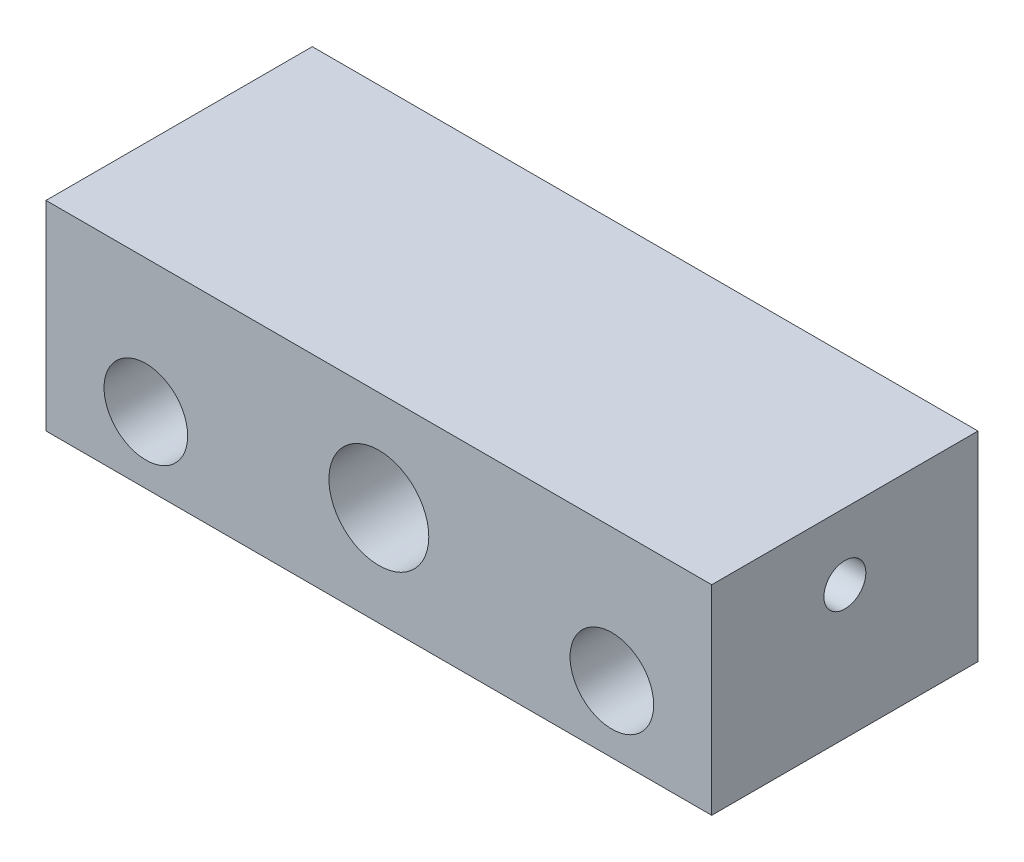
ISO-10303-21;
HEADER;
FILE_DESCRIPTION(('STEP AP214'),'2;1');
FILE_NAME('part.step','',(''),(''),'','','');
FILE_SCHEMA(('AUTOMOTIVE_DESIGN { 1 0 10303 214 1 1 1 1 }'));
ENDSEC;
DATA;
#1=APPLICATION_CONTEXT('core data for automotive mechanical design processes');
#2=APPLICATION_PROTOCOL_DEFINITION('international standard','automotive_design',2000,#1);
#3=PRODUCT_CONTEXT('',#1,'mechanical');
#4=PRODUCT('Part','Part','',(#3));
#5=PRODUCT_RELATED_PRODUCT_CATEGORY('part','',(#4));
#6=PRODUCT_DEFINITION_FORMATION('','',#4);
#7=PRODUCT_DEFINITION_CONTEXT('part definition',#1,'design');
#8=PRODUCT_DEFINITION('design','',#6,#7);
#9=PRODUCT_DEFINITION_SHAPE('','',#8);
#10=(LENGTH_UNIT() NAMED_UNIT(*) SI_UNIT(.MILLI.,.METRE.));
#11=(NAMED_UNIT(*) PLANE_ANGLE_UNIT() SI_UNIT($,.RADIAN.));
#12=(NAMED_UNIT(*) SI_UNIT($,.STERADIAN.) SOLID_ANGLE_UNIT());
#13=UNCERTAINTY_MEASURE_WITH_UNIT(LENGTH_MEASURE(1.E-05),#10,'distance_accuracy_value','');
#14=(GEOMETRIC_REPRESENTATION_CONTEXT(3) GLOBAL_UNCERTAINTY_ASSIGNED_CONTEXT((#13)) GLOBAL_UNIT_ASSIGNED_CONTEXT((#10,
#11,#12)) REPRESENTATION_CONTEXT('',''));
#15=CARTESIAN_POINT('',(0.,0.,0.));
#16=DIRECTION('',(0.,0.,1.));
#17=DIRECTION('',(1.,0.,0.));
#18=AXIS2_PLACEMENT_3D('',#15,#16,#17);
#19=CARTESIAN_POINT('',(31.75,9.525,-25.4));
#20=DIRECTION('',(1.,0.,0.));
#21=DIRECTION('',(0.,1.,0.));
#22=AXIS2_PLACEMENT_3D('',#19,#20,#21);
#23=PLANE('',#22);
#24=CARTESIAN_POINT('',(31.75,3.17500000000001,-12.7));
#25=DIRECTION('',(-1.,0.,0.));
#26=DIRECTION('',(0.,0.,1.));
#27=AXIS2_PLACEMENT_3D('',#24,#25,#26);
#28=CIRCLE('',#27,2.);
#29=CARTESIAN_POINT('',(31.75,3.17500000000001,-10.7));
#30=VERTEX_POINT('',#29);
#31=EDGE_CURVE('E170',#30,#30,#28,.T.);
#32=ORIENTED_EDGE('',*,*,#31,.T.);
#33=EDGE_LOOP('',(#32));
#34=FACE_BOUND('',#33,.T.);
#35=DIRECTION('',(0.,1.,0.));
#36=VECTOR('',#35,1.);
#37=CARTESIAN_POINT('',(31.75,9.525,0.));
#38=LINE('',#37,#36);
#39=CARTESIAN_POINT('',(31.75,-9.525,0.));
#40=VERTEX_POINT('',#39);
#41=CARTESIAN_POINT('',(31.75,9.525,0.));
#42=VERTEX_POINT('',#41);
#43=EDGE_CURVE('E102',#40,#42,#38,.T.);
#44=ORIENTED_EDGE('',*,*,#43,.F.);
#45=DIRECTION('',(0.,0.,1.));
#46=VECTOR('',#45,1.);
#47=CARTESIAN_POINT('',(31.75,-9.525,-25.4));
#48=LINE('',#47,#46);
#49=CARTESIAN_POINT('',(31.75,-9.525,-25.4));
#50=VERTEX_POINT('',#49);
#51=EDGE_CURVE('E11',#50,#40,#48,.T.);
#52=ORIENTED_EDGE('',*,*,#51,.F.);
#53=DIRECTION('',(0.,1.,0.));
#54=VECTOR('',#53,1.);
#55=CARTESIAN_POINT('',(31.75,9.525,-25.4));
#56=LINE('',#55,#54);
#57=CARTESIAN_POINT('',(31.75,9.525,-25.4));
#58=VERTEX_POINT('',#57);
#59=EDGE_CURVE('E95',#50,#58,#56,.T.);
#60=ORIENTED_EDGE('',*,*,#59,.T.);
#61=DIRECTION('',(0.,0.,1.));
#62=VECTOR('',#61,1.);
#63=CARTESIAN_POINT('',(31.75,9.525,-25.4));
#64=LINE('',#63,#62);
#65=EDGE_CURVE('E40',#58,#42,#64,.T.);
#66=ORIENTED_EDGE('',*,*,#65,.T.);
#67=EDGE_LOOP('',(#44,#52,#60,#66));
#68=FACE_BOUND('',#67,.T.);
#69=ADVANCED_FACE('F37',(#34,#68),#23,.T.);
#70=CARTESIAN_POINT('',(-31.75,-9.52500000000001,-25.4));
#71=DIRECTION('',(0.,-1.,0.));
#72=DIRECTION('',(1.,0.,0.));
#73=AXIS2_PLACEMENT_3D('',#70,#71,#72);
#74=PLANE('',#73);
#75=DIRECTION('',(1.,0.,0.));
#76=VECTOR('',#75,1.);
#77=CARTESIAN_POINT('',(-31.75,-9.52500000000001,0.));
#78=LINE('',#77,#76);
#79=CARTESIAN_POINT('',(-31.75,-9.52500000000001,0.));
#80=VERTEX_POINT('',#79);
#81=EDGE_CURVE('E97',#80,#40,#78,.T.);
#82=ORIENTED_EDGE('',*,*,#81,.F.);
#83=DIRECTION('',(0.,0.,1.));
#84=VECTOR('',#83,1.);
#85=CARTESIAN_POINT('',(-31.75,-9.52500000000001,-25.4));
#86=LINE('',#85,#84);
#87=CARTESIAN_POINT('',(-31.75,-9.52500000000001,-25.4));
#88=VERTEX_POINT('',#87);
#89=EDGE_CURVE('E46',#88,#80,#86,.T.);
#90=ORIENTED_EDGE('',*,*,#89,.F.);
#91=DIRECTION('',(1.,0.,0.));
#92=VECTOR('',#91,1.);
#93=CARTESIAN_POINT('',(-31.75,-9.52500000000001,-25.4));
#94=LINE('',#93,#92);
#95=EDGE_CURVE('E92',#88,#50,#94,.T.);
#96=ORIENTED_EDGE('',*,*,#95,.T.);
#97=ORIENTED_EDGE('',*,*,#51,.T.);
#98=EDGE_LOOP('',(#82,#90,#96,#97));
#99=FACE_BOUND('',#98,.T.);
#100=ADVANCED_FACE('F113',(#99),#74,.T.);
#101=CARTESIAN_POINT('',(-31.75,9.52499999999999,-25.4));
#102=DIRECTION('',(-1.,0.,0.));
#103=DIRECTION('',(0.,-1.,0.));
#104=AXIS2_PLACEMENT_3D('',#101,#102,#103);
#105=PLANE('',#104);
#106=CARTESIAN_POINT('',(-31.75,3.175,-12.7));
#107=DIRECTION('',(-1.,0.,0.));
#108=DIRECTION('',(0.,0.,1.));
#109=AXIS2_PLACEMENT_3D('',#106,#107,#108);
#110=CIRCLE('',#109,2.);
#111=CARTESIAN_POINT('',(-31.75,3.175,-10.7));
#112=VERTEX_POINT('',#111);
#113=EDGE_CURVE('E169',#112,#112,#110,.T.);
#114=ORIENTED_EDGE('',*,*,#113,.F.);
#115=EDGE_LOOP('',(#114));
#116=FACE_BOUND('',#115,.T.);
#117=DIRECTION('',(0.,-1.,0.));
#118=VECTOR('',#117,1.);
#119=CARTESIAN_POINT('',(-31.75,9.52499999999999,0.));
#120=LINE('',#119,#118);
#121=CARTESIAN_POINT('',(-31.75,9.52499999999999,0.));
#122=VERTEX_POINT('',#121);
#123=EDGE_CURVE('E87',#122,#80,#120,.T.);
#124=ORIENTED_EDGE('',*,*,#123,.F.);
#125=DIRECTION('',(0.,0.,1.));
#126=VECTOR('',#125,1.);
#127=CARTESIAN_POINT('',(-31.75,9.52499999999999,-25.4));
#128=LINE('',#127,#126);
#129=CARTESIAN_POINT('',(-31.75,9.52499999999999,-25.4));
#130=VERTEX_POINT('',#129);
#131=EDGE_CURVE('E82',#130,#122,#128,.T.);
#132=ORIENTED_EDGE('',*,*,#131,.F.);
#133=DIRECTION('',(0.,-1.,0.));
#134=VECTOR('',#133,1.);
#135=CARTESIAN_POINT('',(-31.75,9.52499999999999,-25.4));
#136=LINE('',#135,#134);
#137=EDGE_CURVE('E85',#130,#88,#136,.T.);
#138=ORIENTED_EDGE('',*,*,#137,.T.);
#139=ORIENTED_EDGE('',*,*,#89,.T.);
#140=EDGE_LOOP('',(#124,#132,#138,#139));
#141=FACE_BOUND('',#140,.T.);
#142=ADVANCED_FACE('F84',(#116,#141),#105,.T.);
#143=CARTESIAN_POINT('',(-31.75,9.52499999999999,-25.4));
#144=DIRECTION('',(0.,1.,0.));
#145=DIRECTION('',(-1.,0.,0.));
#146=AXIS2_PLACEMENT_3D('',#143,#144,#145);
#147=PLANE('',#146);
#148=DIRECTION('',(-1.,0.,0.));
#149=VECTOR('',#148,1.);
#150=CARTESIAN_POINT('',(-31.75,9.52499999999999,0.));
#151=LINE('',#150,#149);
#152=EDGE_CURVE('E105',#42,#122,#151,.T.);
#153=ORIENTED_EDGE('',*,*,#152,.F.);
#154=ORIENTED_EDGE('',*,*,#65,.F.);
#155=DIRECTION('',(-1.,0.,0.));
#156=VECTOR('',#155,1.);
#157=CARTESIAN_POINT('',(-31.75,9.52499999999999,-25.4));
#158=LINE('',#157,#156);
#159=EDGE_CURVE('E91',#58,#130,#158,.T.);
#160=ORIENTED_EDGE('',*,*,#159,.T.);
#161=ORIENTED_EDGE('',*,*,#131,.T.);
#162=EDGE_LOOP('',(#153,#154,#160,#161));
#163=FACE_BOUND('',#162,.T.);
#164=ADVANCED_FACE('F94',(#163),#147,.T.);
#165=CARTESIAN_POINT('',(0.,0.,-25.4));
#166=DIRECTION('',(0.,0.,1.));
#167=DIRECTION('',(1.,0.,0.));
#168=AXIS2_PLACEMENT_3D('',#165,#166,#167);
#169=PLANE('',#168);
#170=CARTESIAN_POINT('',(22.225,-3.17500000000001,-25.4));
#171=DIRECTION('',(0.,0.,1.));
#172=DIRECTION('',(1.,0.,0.));
#173=AXIS2_PLACEMENT_3D('',#170,#171,#172);
#174=CIRCLE('',#173,3.98780000000001);
#175=CARTESIAN_POINT('',(26.2128,-3.17500000000001,-25.4));
#176=VERTEX_POINT('',#175);
#177=EDGE_CURVE('E181',#176,#176,#174,.T.);
#178=ORIENTED_EDGE('',*,*,#177,.T.);
#179=EDGE_LOOP('',(#178));
#180=FACE_BOUND('',#179,.T.);
#181=CARTESIAN_POINT('',(-22.225,-3.17500000000001,-25.4));
#182=DIRECTION('',(0.,0.,1.));
#183=DIRECTION('',(1.,0.,0.));
#184=AXIS2_PLACEMENT_3D('',#181,#182,#183);
#185=CIRCLE('',#184,3.9878);
#186=CARTESIAN_POINT('',(-18.2372,-3.17500000000001,-25.4));
#187=VERTEX_POINT('',#186);
#188=EDGE_CURVE('E186',#187,#187,#185,.T.);
#189=ORIENTED_EDGE('',*,*,#188,.T.);
#190=EDGE_LOOP('',(#189));
#191=FACE_BOUND('',#190,.T.);
#192=CARTESIAN_POINT('',(0.,0.,-25.4));
#193=DIRECTION('',(0.,0.,1.));
#194=DIRECTION('',(1.,0.,0.));
#195=AXIS2_PLACEMENT_3D('',#192,#193,#194);
#196=CIRCLE('',#195,4.7625);
#197=CARTESIAN_POINT('',(4.76249999999999,0.,-25.4));
#198=VERTEX_POINT('',#197);
#199=EDGE_CURVE('E106',#198,#198,#196,.T.);
#200=ORIENTED_EDGE('',*,*,#199,.T.);
#201=EDGE_LOOP('',(#200));
#202=FACE_BOUND('',#201,.T.);
#203=ORIENTED_EDGE('',*,*,#59,.F.);
#204=ORIENTED_EDGE('',*,*,#95,.F.);
#205=ORIENTED_EDGE('',*,*,#137,.F.);
#206=ORIENTED_EDGE('',*,*,#159,.F.);
#207=EDGE_LOOP('',(#203,#204,#205,#206));
#208=FACE_BOUND('',#207,.T.);
#209=ADVANCED_FACE('F90',(#180,#191,#202,#208),#169,.F.);
#210=CARTESIAN_POINT('',(0.,0.,0.));
#211=DIRECTION('',(0.,0.,1.));
#212=DIRECTION('',(1.,0.,0.));
#213=AXIS2_PLACEMENT_3D('',#210,#211,#212);
#214=PLANE('',#213);
#215=CARTESIAN_POINT('',(22.225,-3.17500000000001,0.));
#216=DIRECTION('',(0.,0.,1.));
#217=DIRECTION('',(1.,0.,0.));
#218=AXIS2_PLACEMENT_3D('',#215,#216,#217);
#219=CIRCLE('',#218,3.98780000000001);
#220=CARTESIAN_POINT('',(26.2128,-3.17500000000001,0.));
#221=VERTEX_POINT('',#220);
#222=EDGE_CURVE('E179',#221,#221,#219,.T.);
#223=ORIENTED_EDGE('',*,*,#222,.F.);
#224=EDGE_LOOP('',(#223));
#225=FACE_BOUND('',#224,.T.);
#226=CARTESIAN_POINT('',(-22.225,-3.17500000000001,0.));
#227=DIRECTION('',(0.,0.,1.));
#228=DIRECTION('',(1.,0.,0.));
#229=AXIS2_PLACEMENT_3D('',#226,#227,#228);
#230=CIRCLE('',#229,3.9878);
#231=CARTESIAN_POINT('',(-18.2372,-3.17500000000001,0.));
#232=VERTEX_POINT('',#231);
#233=EDGE_CURVE('E183',#232,#232,#230,.T.);
#234=ORIENTED_EDGE('',*,*,#233,.F.);
#235=EDGE_LOOP('',(#234));
#236=FACE_BOUND('',#235,.T.);
#237=CARTESIAN_POINT('',(0.,0.,0.));
#238=DIRECTION('',(0.,0.,1.));
#239=DIRECTION('',(1.,0.,0.));
#240=AXIS2_PLACEMENT_3D('',#237,#238,#239);
#241=CIRCLE('',#240,4.7625);
#242=CARTESIAN_POINT('',(4.76249999999999,0.,0.));
#243=VERTEX_POINT('',#242);
#244=EDGE_CURVE('E189',#243,#243,#241,.T.);
#245=ORIENTED_EDGE('',*,*,#244,.F.);
#246=EDGE_LOOP('',(#245));
#247=FACE_BOUND('',#246,.T.);
#248=ORIENTED_EDGE('',*,*,#43,.T.);
#249=ORIENTED_EDGE('',*,*,#152,.T.);
#250=ORIENTED_EDGE('',*,*,#123,.T.);
#251=ORIENTED_EDGE('',*,*,#81,.T.);
#252=EDGE_LOOP('',(#248,#249,#250,#251));
#253=FACE_BOUND('',#252,.T.);
#254=ADVANCED_FACE('F112',(#225,#236,#247,#253),#214,.T.);
#255=CARTESIAN_POINT('',(0.,0.,-25.4));
#256=DIRECTION('',(0.,0.,1.));
#257=DIRECTION('',(1.,0.,0.));
#258=AXIS2_PLACEMENT_3D('',#255,#256,#257);
#259=CYLINDRICAL_SURFACE('',#258,4.7625);
#260=ORIENTED_EDGE('',*,*,#199,.F.);
#261=EDGE_LOOP('',(#260));
#262=FACE_BOUND('',#261,.T.);
#263=ORIENTED_EDGE('',*,*,#244,.T.);
#264=EDGE_LOOP('',(#263));
#265=FACE_BOUND('',#264,.T.);
#266=ADVANCED_FACE('F133',(#262,#265),#259,.F.);
#267=CARTESIAN_POINT('',(-22.225,-3.17500000000001,-25.4));
#268=DIRECTION('',(0.,0.,1.));
#269=DIRECTION('',(1.,0.,0.));
#270=AXIS2_PLACEMENT_3D('',#267,#268,#269);
#271=CYLINDRICAL_SURFACE('',#270,3.9878);
#272=ORIENTED_EDGE('',*,*,#188,.F.);
#273=EDGE_LOOP('',(#272));
#274=FACE_BOUND('',#273,.T.);
#275=ORIENTED_EDGE('',*,*,#233,.T.);
#276=EDGE_LOOP('',(#275));
#277=FACE_BOUND('',#276,.T.);
#278=ADVANCED_FACE('F140',(#274,#277),#271,.F.);
#279=CARTESIAN_POINT('',(22.225,-3.17500000000001,-25.4));
#280=DIRECTION('',(0.,0.,1.));
#281=DIRECTION('',(1.,0.,0.));
#282=AXIS2_PLACEMENT_3D('',#279,#280,#281);
#283=CYLINDRICAL_SURFACE('',#282,3.98780000000001);
#284=ORIENTED_EDGE('',*,*,#177,.F.);
#285=EDGE_LOOP('',(#284));
#286=FACE_BOUND('',#285,.T.);
#287=ORIENTED_EDGE('',*,*,#222,.T.);
#288=EDGE_LOOP('',(#287));
#289=FACE_BOUND('',#288,.T.);
#290=ADVANCED_FACE('F144',(#286,#289),#283,.F.);
#291=CARTESIAN_POINT('',(-25.4,3.175,-12.7));
#292=DIRECTION('',(-1.,0.,0.));
#293=DIRECTION('',(0.,0.,1.));
#294=AXIS2_PLACEMENT_3D('',#291,#292,#293);
#295=CYLINDRICAL_SURFACE('',#294,2.);
#296=CARTESIAN_POINT('',(-25.4,3.175,-12.7));
#297=DIRECTION('',(-1.,0.,0.));
#298=DIRECTION('',(0.,0.,1.));
#299=AXIS2_PLACEMENT_3D('',#296,#297,#298);
#300=CIRCLE('',#299,2.);
#301=CARTESIAN_POINT('',(-25.4,3.175,-10.7));
#302=VERTEX_POINT('',#301);
#303=EDGE_CURVE('E173',#302,#302,#300,.T.);
#304=ORIENTED_EDGE('',*,*,#303,.F.);
#305=EDGE_LOOP('',(#304));
#306=FACE_BOUND('',#305,.T.);
#307=ORIENTED_EDGE('',*,*,#113,.T.);
#308=EDGE_LOOP('',(#307));
#309=FACE_BOUND('',#308,.T.);
#310=ADVANCED_FACE('F148',(#306,#309),#295,.F.);
#311=CARTESIAN_POINT('',(-25.4,3.175,-12.7));
#312=DIRECTION('',(-1.,0.,0.));
#313=DIRECTION('',(0.,0.,1.));
#314=AXIS2_PLACEMENT_3D('',#311,#312,#313);
#315=PLANE('',#314);
#316=ORIENTED_EDGE('',*,*,#303,.T.);
#317=EDGE_LOOP('',(#316));
#318=FACE_BOUND('',#317,.T.);
#319=ADVANCED_FACE('F152',(#318),#315,.T.);
#320=CARTESIAN_POINT('',(25.4,3.17500000000001,-12.7));
#321=DIRECTION('',(1.,0.,0.));
#322=DIRECTION('',(0.,1.,0.));
#323=AXIS2_PLACEMENT_3D('',#320,#321,#322);
#324=CYLINDRICAL_SURFACE('',#323,2.);
#325=CARTESIAN_POINT('',(25.4,3.17500000000001,-12.7));
#326=DIRECTION('',(-1.,0.,0.));
#327=DIRECTION('',(0.,0.,1.));
#328=AXIS2_PLACEMENT_3D('',#325,#326,#327);
#329=CIRCLE('',#328,2.);
#330=CARTESIAN_POINT('',(25.4,3.17500000000001,-10.7));
#331=VERTEX_POINT('',#330);
#332=EDGE_CURVE('E168',#331,#331,#329,.T.);
#333=ORIENTED_EDGE('',*,*,#332,.T.);
#334=EDGE_LOOP('',(#333));
#335=FACE_BOUND('',#334,.T.);
#336=ORIENTED_EDGE('',*,*,#31,.F.);
#337=EDGE_LOOP('',(#336));
#338=FACE_BOUND('',#337,.T.);
#339=ADVANCED_FACE('F156',(#335,#338),#324,.F.);
#340=CARTESIAN_POINT('',(25.4,3.17500000000001,-12.7));
#341=DIRECTION('',(1.,0.,0.));
#342=DIRECTION('',(0.,0.,1.));
#343=AXIS2_PLACEMENT_3D('',#340,#341,#342);
#344=PLANE('',#343);
#345=ORIENTED_EDGE('',*,*,#332,.F.);
#346=EDGE_LOOP('',(#345));
#347=FACE_BOUND('',#346,.T.);
#348=ADVANCED_FACE('F160',(#347),#344,.T.);
#349=CLOSED_SHELL('',(#69,#100,#142,#164,#209,#254,#266,#278,#290,#310,#319,#339,#348));
#350=MANIFOLD_SOLID_BREP('B2',#349);
#351=ADVANCED_BREP_SHAPE_REPRESENTATION('',(#18,#350),#14);
#352=SHAPE_DEFINITION_REPRESENTATION(#9,#351);
ENDSEC;
END-ISO-10303-21;
